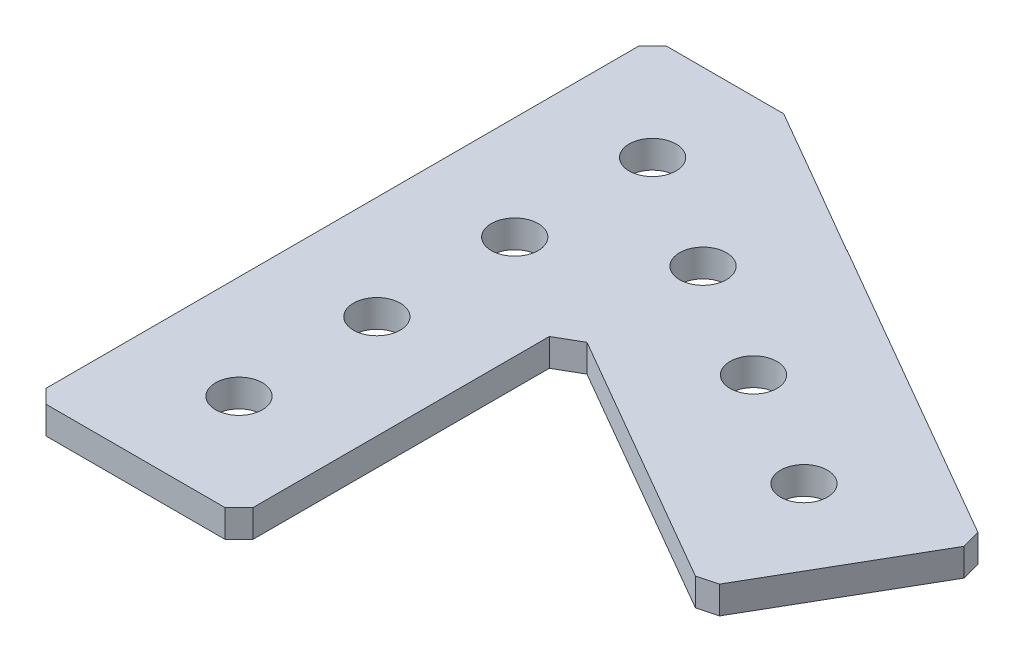
ISO-10303-21;
HEADER;
FILE_DESCRIPTION(('STEP AP214'),'2;1');
FILE_NAME('part.step','',(''),(''),'','','');
FILE_SCHEMA(('AUTOMOTIVE_DESIGN { 1 0 10303 214 1 1 1 1 }'));
ENDSEC;
DATA;
#1=APPLICATION_CONTEXT('core data for automotive mechanical design processes');
#2=APPLICATION_PROTOCOL_DEFINITION('international standard','automotive_design',2000,#1);
#3=PRODUCT_CONTEXT('',#1,'mechanical');
#4=PRODUCT('Part','Part','',(#3));
#5=PRODUCT_RELATED_PRODUCT_CATEGORY('part','',(#4));
#6=PRODUCT_DEFINITION_FORMATION('','',#4);
#7=PRODUCT_DEFINITION_CONTEXT('part definition',#1,'design');
#8=PRODUCT_DEFINITION('design','',#6,#7);
#9=PRODUCT_DEFINITION_SHAPE('','',#8);
#10=(LENGTH_UNIT() NAMED_UNIT(*) SI_UNIT(.MILLI.,.METRE.));
#11=(NAMED_UNIT(*) PLANE_ANGLE_UNIT() SI_UNIT($,.RADIAN.));
#12=(NAMED_UNIT(*) SI_UNIT($,.STERADIAN.) SOLID_ANGLE_UNIT());
#13=UNCERTAINTY_MEASURE_WITH_UNIT(LENGTH_MEASURE(1.E-05),#10,'distance_accuracy_value','');
#14=(GEOMETRIC_REPRESENTATION_CONTEXT(3) GLOBAL_UNCERTAINTY_ASSIGNED_CONTEXT((#13)) GLOBAL_UNIT_ASSIGNED_CONTEXT((#10,
#11,#12)) REPRESENTATION_CONTEXT('',''));
#15=CARTESIAN_POINT('',(0.,0.,0.));
#16=DIRECTION('',(0.,0.,1.));
#17=DIRECTION('',(1.,0.,0.));
#18=AXIS2_PLACEMENT_3D('',#15,#16,#17);
#19=CARTESIAN_POINT('',(7.50000000000001,2.,36.5));
#20=DIRECTION('',(-0.707106781186544,0.,-0.707106781186551));
#21=DIRECTION('',(-0.707106781186551,0.,0.707106781186544));
#22=AXIS2_PLACEMENT_3D('',#19,#20,#21);
#23=PLANE('',#22);
#24=DIRECTION('',(0.,1.,0.));
#25=VECTOR('',#24,1.);
#26=CARTESIAN_POINT('',(6.5,2.,37.5));
#27=LINE('',#26,#25);
#28=CARTESIAN_POINT('',(6.49999999999999,2.,37.5));
#29=VERTEX_POINT('',#28);
#30=CARTESIAN_POINT('',(6.5,0.,37.5));
#31=VERTEX_POINT('',#30);
#32=EDGE_CURVE('E151',#29,#31,#27,.F.);
#33=ORIENTED_EDGE('',*,*,#32,.T.);
#34=DIRECTION('',(-0.707106781186551,0.,0.707106781186544));
#35=VECTOR('',#34,1.);
#36=CARTESIAN_POINT('',(7.50000000000001,0.,36.5));
#37=LINE('',#36,#35);
#38=CARTESIAN_POINT('',(7.5,0.,36.5));
#39=VERTEX_POINT('',#38);
#40=EDGE_CURVE('E178',#39,#31,#37,.T.);
#41=ORIENTED_EDGE('',*,*,#40,.F.);
#42=DIRECTION('',(0.,1.,0.));
#43=VECTOR('',#42,1.);
#44=CARTESIAN_POINT('',(7.50000000000001,2.,36.5));
#45=LINE('',#44,#43);
#46=CARTESIAN_POINT('',(7.5,2.,36.5));
#47=VERTEX_POINT('',#46);
#48=EDGE_CURVE('E482',#39,#47,#45,.T.);
#49=ORIENTED_EDGE('',*,*,#48,.T.);
#50=DIRECTION('',(0.707106781186552,0.,-0.707106781186543));
#51=VECTOR('',#50,1.);
#52=CARTESIAN_POINT('',(6.5,2.,37.5));
#53=LINE('',#52,#51);
#54=EDGE_CURVE('E127',#29,#47,#53,.T.);
#55=ORIENTED_EDGE('',*,*,#54,.F.);
#56=EDGE_LOOP('',(#33,#41,#49,#55));
#57=FACE_BOUND('',#56,.T.);
#58=ADVANCED_FACE('F17',(#57),#23,.F.);
#59=CARTESIAN_POINT('',(29.2259526419165,2.,24.3791651245988));
#60=DIRECTION('',(-0.258819045102525,0.,-0.965925826289067));
#61=DIRECTION('',(-0.965925826289067,0.,0.258819045102525));
#62=AXIS2_PLACEMENT_3D('',#59,#60,#61);
#63=PLANE('',#62);
#64=DIRECTION('',(0.,1.,0.));
#65=VECTOR('',#64,1.);
#66=CARTESIAN_POINT('',(27.8599272381321,2.,24.7451905283832));
#67=LINE('',#66,#65);
#68=CARTESIAN_POINT('',(27.8599272381321,2.,24.7451905283832));
#69=VERTEX_POINT('',#68);
#70=CARTESIAN_POINT('',(27.8599272381321,0.,24.7451905283832));
#71=VERTEX_POINT('',#70);
#72=EDGE_CURVE('E537',#69,#71,#67,.F.);
#73=ORIENTED_EDGE('',*,*,#72,.T.);
#74=DIRECTION('',(-0.965925826289067,0.,0.258819045102525));
#75=VECTOR('',#74,1.);
#76=CARTESIAN_POINT('',(29.2259526419165,0.,24.3791651245988));
#77=LINE('',#76,#75);
#78=CARTESIAN_POINT('',(29.2259526419165,0.,24.3791651245988));
#79=VERTEX_POINT('',#78);
#80=EDGE_CURVE('E176',#79,#71,#77,.T.);
#81=ORIENTED_EDGE('',*,*,#80,.F.);
#82=DIRECTION('',(0.,1.,0.));
#83=VECTOR('',#82,1.);
#84=CARTESIAN_POINT('',(29.2259526419165,2.,24.3791651245988));
#85=LINE('',#84,#83);
#86=CARTESIAN_POINT('',(29.2259526419165,2.,24.3791651245988));
#87=VERTEX_POINT('',#86);
#88=EDGE_CURVE('E525',#79,#87,#85,.T.);
#89=ORIENTED_EDGE('',*,*,#88,.T.);
#90=DIRECTION('',(0.965925826289068,0.,-0.258819045102521));
#91=VECTOR('',#90,1.);
#92=CARTESIAN_POINT('',(27.8599272381321,2.,24.7451905283832));
#93=LINE('',#92,#91);
#94=EDGE_CURVE('E166',#69,#87,#93,.T.);
#95=ORIENTED_EDGE('',*,*,#94,.F.);
#96=EDGE_LOOP('',(#73,#81,#89,#95));
#97=FACE_BOUND('',#96,.T.);
#98=ADVANCED_FACE('F455',(#97),#63,.F.);
#99=CARTESIAN_POINT('',(35.359927238132,2.,11.7548094716166));
#100=DIRECTION('',(-0.965925826289066,0.,0.258819045102529));
#101=DIRECTION('',(0.258819045102529,0.,0.965925826289066));
#102=AXIS2_PLACEMENT_3D('',#99,#100,#101);
#103=PLANE('',#102);
#104=DIRECTION('',(0.,1.,0.));
#105=VECTOR('',#104,1.);
#106=CARTESIAN_POINT('',(35.7259526419165,2.,13.1208348754011));
#107=LINE('',#106,#105);
#108=CARTESIAN_POINT('',(35.7259526419165,2.,13.1208348754011));
#109=VERTEX_POINT('',#108);
#110=CARTESIAN_POINT('',(35.7259526419165,0.,13.1208348754011));
#111=VERTEX_POINT('',#110);
#112=EDGE_CURVE('E528',#109,#111,#107,.F.);
#113=ORIENTED_EDGE('',*,*,#112,.T.);
#114=DIRECTION('',(0.258819045102529,0.,0.965925826289066));
#115=VECTOR('',#114,1.);
#116=CARTESIAN_POINT('',(35.359927238132,0.,11.7548094716166));
#117=LINE('',#116,#115);
#118=CARTESIAN_POINT('',(35.359927238132,0.,11.7548094716166));
#119=VERTEX_POINT('',#118);
#120=EDGE_CURVE('E174',#119,#111,#117,.T.);
#121=ORIENTED_EDGE('',*,*,#120,.F.);
#122=DIRECTION('',(0.,1.,0.));
#123=VECTOR('',#122,1.);
#124=CARTESIAN_POINT('',(35.359927238132,2.,11.7548094716166));
#125=LINE('',#124,#123);
#126=CARTESIAN_POINT('',(35.359927238132,2.,11.7548094716166));
#127=VERTEX_POINT('',#126);
#128=EDGE_CURVE('E519',#119,#127,#125,.T.);
#129=ORIENTED_EDGE('',*,*,#128,.T.);
#130=DIRECTION('',(-0.258819045102522,0.,-0.965925826289068));
#131=VECTOR('',#130,1.);
#132=CARTESIAN_POINT('',(35.7259526419165,2.,13.1208348754011));
#133=LINE('',#132,#131);
#134=EDGE_CURVE('E164',#109,#127,#133,.T.);
#135=ORIENTED_EDGE('',*,*,#134,.F.);
#136=EDGE_LOOP('',(#113,#121,#129,#135));
#137=FACE_BOUND('',#136,.T.);
#138=ADVANCED_FACE('F446',(#137),#103,.F.);
#139=CARTESIAN_POINT('',(12.9048348660632,0.,-17.58131199324));
#140=DIRECTION('',(1.,0.,0.));
#141=DIRECTION('',(0.,0.,-1.));
#142=AXIS2_PLACEMENT_3D('',#139,#140,#141);
#143=PLANE('',#142);
#144=DIRECTION('',(0.,1.,0.));
#145=VECTOR('',#144,1.);
#146=CARTESIAN_POINT('',(12.9048348660632,0.,-1.18824976863152));
#147=LINE('',#146,#145);
#148=CARTESIAN_POINT('',(12.9048348660632,0.,-1.18824976863152));
#149=VERTEX_POINT('',#148);
#150=CARTESIAN_POINT('',(12.9048348660632,2.,-1.18824976863152));
#151=VERTEX_POINT('',#150);
#152=EDGE_CURVE('E510',#149,#151,#147,.T.);
#153=ORIENTED_EDGE('',*,*,#152,.T.);
#154=DIRECTION('',(0.,0.,1.));
#155=VECTOR('',#154,1.);
#156=CARTESIAN_POINT('',(12.9048348660632,2.,0.));
#157=LINE('',#156,#155);
#158=CARTESIAN_POINT('',(12.9048348660632,2.,-1.20964415407516));
#159=VERTEX_POINT('',#158);
#160=EDGE_CURVE('E162',#159,#151,#157,.T.);
#161=ORIENTED_EDGE('',*,*,#160,.F.);
#162=DIRECTION('',(0.,1.,0.));
#163=VECTOR('',#162,1.);
#164=CARTESIAN_POINT('',(12.9048348660632,2.,-1.20964415407516));
#165=LINE('',#164,#163);
#166=CARTESIAN_POINT('',(12.9048348660632,0.,-1.20964415407516));
#167=VERTEX_POINT('',#166);
#168=EDGE_CURVE('E513',#159,#167,#165,.F.);
#169=ORIENTED_EDGE('',*,*,#168,.T.);
#170=DIRECTION('',(0.,0.,-1.));
#171=VECTOR('',#170,1.);
#172=CARTESIAN_POINT('',(12.9048348660632,0.,-17.58131199324));
#173=LINE('',#172,#171);
#174=EDGE_CURVE('E172',#149,#167,#173,.T.);
#175=ORIENTED_EDGE('',*,*,#174,.F.);
#176=EDGE_LOOP('',(#153,#161,#169,#175));
#177=FACE_BOUND('',#176,.T.);
#178=ADVANCED_FACE('F438',(#177),#143,.F.);
#179=CARTESIAN_POINT('',(-7.5,2.,-6.50000000000001));
#180=DIRECTION('',(0.707106781186548,0.,0.707106781186548));
#181=DIRECTION('',(0.707106781186548,0.,-0.707106781186548));
#182=AXIS2_PLACEMENT_3D('',#179,#180,#181);
#183=PLANE('',#182);
#184=DIRECTION('',(0.,1.,0.));
#185=VECTOR('',#184,1.);
#186=CARTESIAN_POINT('',(-6.50000000000001,2.,-7.5));
#187=LINE('',#186,#185);
#188=CARTESIAN_POINT('',(-6.50000000000001,2.,-7.5));
#189=VERTEX_POINT('',#188);
#190=CARTESIAN_POINT('',(-6.50000000000001,0.,-7.5));
#191=VERTEX_POINT('',#190);
#192=EDGE_CURVE('E495',#189,#191,#187,.F.);
#193=ORIENTED_EDGE('',*,*,#192,.T.);
#194=DIRECTION('',(0.707106781186548,0.,-0.707106781186548));
#195=VECTOR('',#194,1.);
#196=CARTESIAN_POINT('',(-7.5,0.,-6.50000000000001));
#197=LINE('',#196,#195);
#198=CARTESIAN_POINT('',(-7.5,0.,-6.50000000000001));
#199=VERTEX_POINT('',#198);
#200=EDGE_CURVE('E35',#199,#191,#197,.T.);
#201=ORIENTED_EDGE('',*,*,#200,.F.);
#202=DIRECTION('',(0.,1.,0.));
#203=VECTOR('',#202,1.);
#204=CARTESIAN_POINT('',(-7.5,2.,-6.50000000000001));
#205=LINE('',#204,#203);
#206=CARTESIAN_POINT('',(-7.5,2.,-6.50000000000001));
#207=VERTEX_POINT('',#206);
#208=EDGE_CURVE('E493',#199,#207,#205,.T.);
#209=ORIENTED_EDGE('',*,*,#208,.T.);
#210=DIRECTION('',(-0.707106781186548,0.,0.707106781186548));
#211=VECTOR('',#210,1.);
#212=CARTESIAN_POINT('',(-6.50000000000001,2.,-7.5));
#213=LINE('',#212,#211);
#214=EDGE_CURVE('E143',#189,#207,#213,.T.);
#215=ORIENTED_EDGE('',*,*,#214,.F.);
#216=EDGE_LOOP('',(#193,#201,#209,#215));
#217=FACE_BOUND('',#216,.T.);
#218=ADVANCED_FACE('F430',(#217),#183,.F.);
#219=CARTESIAN_POINT('',(-6.5,2.,37.5));
#220=DIRECTION('',(0.70710678118655,0.,-0.707106781186545));
#221=DIRECTION('',(-0.707106781186545,0.,-0.70710678118655));
#222=AXIS2_PLACEMENT_3D('',#219,#220,#221);
#223=PLANE('',#222);
#224=DIRECTION('',(0.,1.,0.));
#225=VECTOR('',#224,1.);
#226=CARTESIAN_POINT('',(-7.5,2.,36.5));
#227=LINE('',#226,#225);
#228=CARTESIAN_POINT('',(-7.5,2.,36.5));
#229=VERTEX_POINT('',#228);
#230=CARTESIAN_POINT('',(-7.50000000000001,0.,36.5));
#231=VERTEX_POINT('',#230);
#232=EDGE_CURVE('E210',#229,#231,#227,.F.);
#233=ORIENTED_EDGE('',*,*,#232,.T.);
#234=DIRECTION('',(-0.707106781186545,0.,-0.70710678118655));
#235=VECTOR('',#234,1.);
#236=CARTESIAN_POINT('',(-6.5,0.,37.5));
#237=LINE('',#236,#235);
#238=CARTESIAN_POINT('',(-6.5,0.,37.5));
#239=VERTEX_POINT('',#238);
#240=EDGE_CURVE('E154',#239,#231,#237,.T.);
#241=ORIENTED_EDGE('',*,*,#240,.F.);
#242=DIRECTION('',(0.,1.,0.));
#243=VECTOR('',#242,1.);
#244=CARTESIAN_POINT('',(-6.5,2.,37.5));
#245=LINE('',#244,#243);
#246=CARTESIAN_POINT('',(-6.5,2.,37.5));
#247=VERTEX_POINT('',#246);
#248=EDGE_CURVE('E149',#239,#247,#245,.T.);
#249=ORIENTED_EDGE('',*,*,#248,.T.);
#250=DIRECTION('',(0.707106781186544,0.,0.707106781186551));
#251=VECTOR('',#250,1.);
#252=CARTESIAN_POINT('',(-7.5,2.,36.5));
#253=LINE('',#252,#251);
#254=EDGE_CURVE('E133',#229,#247,#253,.T.);
#255=ORIENTED_EDGE('',*,*,#254,.F.);
#256=EDGE_LOOP('',(#233,#241,#249,#255));
#257=FACE_BOUND('',#256,.T.);
#258=ADVANCED_FACE('F153',(#257),#223,.F.);
#259=CARTESIAN_POINT('',(0.,2.,0.));
#260=DIRECTION('',(0.,1.,0.));
#261=DIRECTION('',(0.,0.,1.));
#262=AXIS2_PLACEMENT_3D('',#259,#260,#261);
#263=PLANE('',#262);
#264=CARTESIAN_POINT('',(0.,2.,20.));
#265=DIRECTION('',(0.,-1.,0.));
#266=DIRECTION('',(0.,0.,-1.));
#267=AXIS2_PLACEMENT_3D('',#264,#265,#266);
#268=CIRCLE('',#267,1.7);
#269=CARTESIAN_POINT('',(0.,2.,18.3));
#270=VERTEX_POINT('',#269);
#271=EDGE_CURVE('E199',#270,#270,#268,.T.);
#272=ORIENTED_EDGE('',*,*,#271,.T.);
#273=EDGE_LOOP('',(#272));
#274=FACE_BOUND('',#273,.T.);
#275=CARTESIAN_POINT('',(0.,2.,30.));
#276=DIRECTION('',(0.,-1.,0.));
#277=DIRECTION('',(0.,0.,-1.));
#278=AXIS2_PLACEMENT_3D('',#275,#276,#277);
#279=CIRCLE('',#278,1.7);
#280=CARTESIAN_POINT('',(0.,2.,28.3));
#281=VERTEX_POINT('',#280);
#282=EDGE_CURVE('E202',#281,#281,#279,.T.);
#283=ORIENTED_EDGE('',*,*,#282,.T.);
#284=EDGE_LOOP('',(#283));
#285=FACE_BOUND('',#284,.T.);
#286=CARTESIAN_POINT('',(17.3205080756888,2.,9.99999999999996));
#287=DIRECTION('',(0.,-1.,0.));
#288=DIRECTION('',(0.,0.,-1.));
#289=AXIS2_PLACEMENT_3D('',#286,#287,#288);
#290=CIRCLE('',#289,1.7);
#291=CARTESIAN_POINT('',(17.3205080756888,2.,8.29999999999996));
#292=VERTEX_POINT('',#291);
#293=EDGE_CURVE('E205',#292,#292,#290,.T.);
#294=ORIENTED_EDGE('',*,*,#293,.T.);
#295=EDGE_LOOP('',(#294));
#296=FACE_BOUND('',#295,.T.);
#297=CARTESIAN_POINT('',(25.9807621135332,2.,14.9999999999999));
#298=DIRECTION('',(0.,-1.,0.));
#299=DIRECTION('',(0.,0.,-1.));
#300=AXIS2_PLACEMENT_3D('',#297,#298,#299);
#301=CIRCLE('',#300,1.7);
#302=CARTESIAN_POINT('',(25.9807621135332,2.,13.2999999999999));
#303=VERTEX_POINT('',#302);
#304=EDGE_CURVE('E208',#303,#303,#301,.T.);
#305=ORIENTED_EDGE('',*,*,#304,.T.);
#306=EDGE_LOOP('',(#305));
#307=FACE_BOUND('',#306,.T.);
#308=CARTESIAN_POINT('',(0.,2.,0.));
#309=DIRECTION('',(0.,-1.,0.));
#310=DIRECTION('',(0.,0.,-1.));
#311=AXIS2_PLACEMENT_3D('',#308,#309,#310);
#312=CIRCLE('',#311,1.7);
#313=CARTESIAN_POINT('',(0.,2.,-1.69999999999999));
#314=VERTEX_POINT('',#313);
#315=EDGE_CURVE('E155',#314,#314,#312,.T.);
#316=ORIENTED_EDGE('',*,*,#315,.T.);
#317=EDGE_LOOP('',(#316));
#318=FACE_BOUND('',#317,.T.);
#319=CARTESIAN_POINT('',(8.66025403784441,2.,4.99999999999998));
#320=DIRECTION('',(0.,-1.,0.));
#321=DIRECTION('',(0.,0.,-1.));
#322=AXIS2_PLACEMENT_3D('',#319,#320,#321);
#323=CIRCLE('',#322,1.7);
#324=CARTESIAN_POINT('',(8.66025403784441,2.,3.29999999999998));
#325=VERTEX_POINT('',#324);
#326=EDGE_CURVE('E158',#325,#325,#323,.T.);
#327=ORIENTED_EDGE('',*,*,#326,.T.);
#328=EDGE_LOOP('',(#327));
#329=FACE_BOUND('',#328,.T.);
#330=CARTESIAN_POINT('',(0.,2.,10.));
#331=DIRECTION('',(0.,-1.,0.));
#332=DIRECTION('',(0.,0.,-1.));
#333=AXIS2_PLACEMENT_3D('',#330,#331,#332);
#334=CIRCLE('',#333,1.7);
#335=CARTESIAN_POINT('',(0.,2.,8.30000000000001));
#336=VERTEX_POINT('',#335);
#337=EDGE_CURVE('E20',#336,#336,#334,.T.);
#338=ORIENTED_EDGE('',*,*,#337,.T.);
#339=EDGE_LOOP('',(#338));
#340=FACE_BOUND('',#339,.T.);
#341=DIRECTION('',(0.86602540378444,0.,0.499999999999998));
#342=VECTOR('',#341,1.);
#343=CARTESIAN_POINT('',(7.5,2.,-4.33012701892221));
#344=LINE('',#343,#342);
#345=CARTESIAN_POINT('',(7.49999999999934,2.,-4.33012701892259));
#346=VERTEX_POINT('',#345);
#347=CARTESIAN_POINT('',(2.00961894323341,2.,-7.5));
#348=VERTEX_POINT('',#347);
#349=EDGE_CURVE('E503',#346,#348,#344,.F.);
#350=ORIENTED_EDGE('',*,*,#349,.T.);
#351=DIRECTION('',(1.,0.,0.));
#352=VECTOR('',#351,1.);
#353=CARTESIAN_POINT('',(-7.5,2.,-7.5));
#354=LINE('',#353,#352);
#355=EDGE_CURVE('E497',#348,#189,#354,.F.);
#356=ORIENTED_EDGE('',*,*,#355,.T.);
#357=ORIENTED_EDGE('',*,*,#214,.T.);
#358=DIRECTION('',(0.,0.,-1.));
#359=VECTOR('',#358,1.);
#360=CARTESIAN_POINT('',(-7.5,2.,-7.5));
#361=LINE('',#360,#359);
#362=EDGE_CURVE('E138',#207,#229,#361,.F.);
#363=ORIENTED_EDGE('',*,*,#362,.T.);
#364=ORIENTED_EDGE('',*,*,#254,.T.);
#365=DIRECTION('',(-1.,0.,0.));
#366=VECTOR('',#365,1.);
#367=CARTESIAN_POINT('',(-7.5,2.,37.5));
#368=LINE('',#367,#366);
#369=EDGE_CURVE('E136',#247,#29,#368,.F.);
#370=ORIENTED_EDGE('',*,*,#369,.T.);
#371=ORIENTED_EDGE('',*,*,#54,.T.);
#372=DIRECTION('',(0.,0.,1.));
#373=VECTOR('',#372,1.);
#374=CARTESIAN_POINT('',(7.5,2.,-7.5));
#375=LINE('',#374,#373);
#376=CARTESIAN_POINT('',(7.5,2.,14.9903810567666));
#377=VERTEX_POINT('',#376);
#378=EDGE_CURVE('E544',#47,#377,#375,.F.);
#379=ORIENTED_EDGE('',*,*,#378,.T.);
#380=DIRECTION('',(0.866025403784435,0.,-0.500000000000006));
#381=VECTOR('',#380,1.);
#382=CARTESIAN_POINT('',(9.23205080756888,2.,13.9903810567665));
#383=LINE('',#382,#381);
#384=CARTESIAN_POINT('',(9.23205080756888,2.,13.9903810567665));
#385=VERTEX_POINT('',#384);
#386=EDGE_CURVE('E542',#385,#377,#383,.F.);
#387=ORIENTED_EDGE('',*,*,#386,.F.);
#388=DIRECTION('',(-0.86602540378444,0.,-0.499999999999998));
#389=VECTOR('',#388,1.);
#390=CARTESIAN_POINT('',(-10.2451905283833,2.,2.74519052838332));
#391=LINE('',#390,#389);
#392=EDGE_CURVE('E531',#385,#69,#391,.F.);
#393=ORIENTED_EDGE('',*,*,#392,.T.);
#394=ORIENTED_EDGE('',*,*,#94,.T.);
#395=DIRECTION('',(-0.499999999999998,0.,0.86602540378444));
#396=VECTOR('',#395,1.);
#397=CARTESIAN_POINT('',(28.7259526419165,2.,25.2451905283832));
#398=LINE('',#397,#396);
#399=EDGE_CURVE('E522',#87,#109,#398,.F.);
#400=ORIENTED_EDGE('',*,*,#399,.T.);
#401=ORIENTED_EDGE('',*,*,#134,.T.);
#402=DIRECTION('',(0.86602540378444,0.,0.499999999999998));
#403=VECTOR('',#402,1.);
#404=CARTESIAN_POINT('',(-2.74519052838331,2.,-10.2451905283833));
#405=LINE('',#404,#403);
#406=EDGE_CURVE('E516',#127,#159,#405,.F.);
#407=ORIENTED_EDGE('',*,*,#406,.T.);
#408=ORIENTED_EDGE('',*,*,#160,.T.);
#409=DIRECTION('',(0.864539754700675,0.,0.502564436209027));
#410=VECTOR('',#409,1.);
#411=CARTESIAN_POINT('',(12.9048348660632,2.,-1.18824976863152));
#412=LINE('',#411,#410);
#413=EDGE_CURVE('E508',#151,#346,#412,.F.);
#414=ORIENTED_EDGE('',*,*,#413,.T.);
#415=EDGE_LOOP('',(#350,#356,#357,#363,#364,#370,#371,#379,#387,#393,#394,#400,#401,#407,#408,#414));
#416=FACE_BOUND('',#415,.T.);
#417=ADVANCED_FACE('F135',(#274,#285,#296,#307,#318,#329,#340,#416),#263,.T.);
#418=CARTESIAN_POINT('',(0.,2.,10.));
#419=DIRECTION('',(0.,-1.,0.));
#420=DIRECTION('',(0.,0.,-1.));
#421=AXIS2_PLACEMENT_3D('',#418,#419,#420);
#422=CYLINDRICAL_SURFACE('',#421,1.7);
#423=CARTESIAN_POINT('',(0.,0.,10.));
#424=DIRECTION('',(0.,-1.,0.));
#425=DIRECTION('',(0.,0.,-1.));
#426=AXIS2_PLACEMENT_3D('',#423,#424,#425);
#427=CIRCLE('',#426,1.7);
#428=CARTESIAN_POINT('',(0.,0.,8.30000000000001));
#429=VERTEX_POINT('',#428);
#430=EDGE_CURVE('E196',#429,#429,#427,.T.);
#431=ORIENTED_EDGE('',*,*,#430,.T.);
#432=EDGE_LOOP('',(#431));
#433=FACE_BOUND('',#432,.T.);
#434=ORIENTED_EDGE('',*,*,#337,.F.);
#435=EDGE_LOOP('',(#434));
#436=FACE_BOUND('',#435,.T.);
#437=ADVANCED_FACE('F218',(#433,#436),#422,.F.);
#438=CARTESIAN_POINT('',(8.66025403784441,2.,4.99999999999998));
#439=DIRECTION('',(0.,-1.,0.));
#440=DIRECTION('',(0.,0.,-1.));
#441=AXIS2_PLACEMENT_3D('',#438,#439,#440);
#442=CYLINDRICAL_SURFACE('',#441,1.7);
#443=CARTESIAN_POINT('',(8.66025403784441,0.,4.99999999999998));
#444=DIRECTION('',(0.,-1.,0.));
#445=DIRECTION('',(0.,0.,-1.));
#446=AXIS2_PLACEMENT_3D('',#443,#444,#445);
#447=CIRCLE('',#446,1.7);
#448=CARTESIAN_POINT('',(8.66025403784441,0.,3.29999999999998));
#449=VERTEX_POINT('',#448);
#450=EDGE_CURVE('E193',#449,#449,#447,.T.);
#451=ORIENTED_EDGE('',*,*,#450,.T.);
#452=EDGE_LOOP('',(#451));
#453=FACE_BOUND('',#452,.T.);
#454=ORIENTED_EDGE('',*,*,#326,.F.);
#455=EDGE_LOOP('',(#454));
#456=FACE_BOUND('',#455,.T.);
#457=ADVANCED_FACE('F220',(#453,#456),#442,.F.);
#458=CARTESIAN_POINT('',(0.,2.,0.));
#459=DIRECTION('',(0.,-1.,0.));
#460=DIRECTION('',(0.,0.,-1.));
#461=AXIS2_PLACEMENT_3D('',#458,#459,#460);
#462=CYLINDRICAL_SURFACE('',#461,1.7);
#463=CARTESIAN_POINT('',(0.,0.,0.));
#464=DIRECTION('',(0.,-1.,0.));
#465=DIRECTION('',(0.,0.,-1.));
#466=AXIS2_PLACEMENT_3D('',#463,#464,#465);
#467=CIRCLE('',#466,1.7);
#468=CARTESIAN_POINT('',(0.,0.,-1.69999999999999));
#469=VERTEX_POINT('',#468);
#470=EDGE_CURVE('E189',#469,#469,#467,.T.);
#471=ORIENTED_EDGE('',*,*,#470,.T.);
#472=EDGE_LOOP('',(#471));
#473=FACE_BOUND('',#472,.T.);
#474=ORIENTED_EDGE('',*,*,#315,.F.);
#475=EDGE_LOOP('',(#474));
#476=FACE_BOUND('',#475,.T.);
#477=ADVANCED_FACE('F228',(#473,#476),#462,.F.);
#478=CARTESIAN_POINT('',(-7.5,2.,37.5));
#479=DIRECTION('',(0.,0.,-1.));
#480=DIRECTION('',(-1.,0.,0.));
#481=AXIS2_PLACEMENT_3D('',#478,#479,#480);
#482=PLANE('',#481);
#483=ORIENTED_EDGE('',*,*,#32,.F.);
#484=ORIENTED_EDGE('',*,*,#369,.F.);
#485=ORIENTED_EDGE('',*,*,#248,.F.);
#486=DIRECTION('',(1.,0.,0.));
#487=VECTOR('',#486,1.);
#488=CARTESIAN_POINT('',(0.,0.,37.5));
#489=LINE('',#488,#487);
#490=EDGE_CURVE('E192',#239,#31,#489,.T.);
#491=ORIENTED_EDGE('',*,*,#490,.T.);
#492=EDGE_LOOP('',(#483,#484,#485,#491));
#493=FACE_BOUND('',#492,.T.);
#494=ADVANCED_FACE('F147',(#493),#482,.F.);
#495=CARTESIAN_POINT('',(7.5,2.,-7.5));
#496=DIRECTION('',(-1.,0.,0.));
#497=DIRECTION('',(0.,0.,1.));
#498=AXIS2_PLACEMENT_3D('',#495,#496,#497);
#499=PLANE('',#498);
#500=DIRECTION('',(0.,1.,0.));
#501=VECTOR('',#500,1.);
#502=CARTESIAN_POINT('',(7.5,2.,14.9903810567666));
#503=LINE('',#502,#501);
#504=CARTESIAN_POINT('',(7.5,0.,14.9903810567666));
#505=VERTEX_POINT('',#504);
#506=EDGE_CURVE('E540',#377,#505,#503,.F.);
#507=ORIENTED_EDGE('',*,*,#506,.F.);
#508=ORIENTED_EDGE('',*,*,#378,.F.);
#509=ORIENTED_EDGE('',*,*,#48,.F.);
#510=DIRECTION('',(0.,0.,1.));
#511=VECTOR('',#510,1.);
#512=CARTESIAN_POINT('',(7.50000000000001,0.,0.));
#513=LINE('',#512,#511);
#514=EDGE_CURVE('E484',#39,#505,#513,.F.);
#515=ORIENTED_EDGE('',*,*,#514,.T.);
#516=EDGE_LOOP('',(#507,#508,#509,#515));
#517=FACE_BOUND('',#516,.T.);
#518=ADVANCED_FACE('F289',(#517),#499,.F.);
#519=CARTESIAN_POINT('',(9.23205080756888,2.,13.9903810567665));
#520=DIRECTION('',(0.500000000000006,0.,0.866025403784435));
#521=DIRECTION('',(0.866025403784435,0.,-0.500000000000006));
#522=AXIS2_PLACEMENT_3D('',#519,#520,#521);
#523=PLANE('',#522);
#524=DIRECTION('',(0.866025403784434,0.,-0.500000000000007));
#525=VECTOR('',#524,1.);
#526=CARTESIAN_POINT('',(7.5,0.,14.9903810567666));
#527=LINE('',#526,#525);
#528=CARTESIAN_POINT('',(9.23205080756888,0.,13.9903810567665));
#529=VERTEX_POINT('',#528);
#530=EDGE_CURVE('E487',#505,#529,#527,.T.);
#531=ORIENTED_EDGE('',*,*,#530,.T.);
#532=DIRECTION('',(0.,1.,0.));
#533=VECTOR('',#532,1.);
#534=CARTESIAN_POINT('',(9.23205080756888,2.,13.9903810567665));
#535=LINE('',#534,#533);
#536=EDGE_CURVE('E534',#529,#385,#535,.T.);
#537=ORIENTED_EDGE('',*,*,#536,.T.);
#538=ORIENTED_EDGE('',*,*,#386,.T.);
#539=ORIENTED_EDGE('',*,*,#506,.T.);
#540=EDGE_LOOP('',(#531,#537,#538,#539));
#541=FACE_BOUND('',#540,.T.);
#542=ADVANCED_FACE('F285',(#541),#523,.T.);
#543=CARTESIAN_POINT('',(-10.2451905283833,2.,2.74519052838332));
#544=DIRECTION('',(0.499999999999998,0.,-0.86602540378444));
#545=DIRECTION('',(-0.86602540378444,0.,-0.499999999999998));
#546=AXIS2_PLACEMENT_3D('',#543,#544,#545);
#547=PLANE('',#546);
#548=ORIENTED_EDGE('',*,*,#536,.F.);
#549=DIRECTION('',(0.86602540378444,0.,0.499999999999998));
#550=VECTOR('',#549,1.);
#551=CARTESIAN_POINT('',(9.23205080756888,0.,13.9903810567665));
#552=LINE('',#551,#550);
#553=EDGE_CURVE('E554',#529,#71,#552,.T.);
#554=ORIENTED_EDGE('',*,*,#553,.T.);
#555=ORIENTED_EDGE('',*,*,#72,.F.);
#556=ORIENTED_EDGE('',*,*,#392,.F.);
#557=EDGE_LOOP('',(#548,#554,#555,#556));
#558=FACE_BOUND('',#557,.T.);
#559=ADVANCED_FACE('F281',(#558),#547,.F.);
#560=CARTESIAN_POINT('',(28.7259526419165,2.,25.2451905283832));
#561=DIRECTION('',(-0.86602540378444,0.,-0.499999999999998));
#562=DIRECTION('',(-0.499999999999998,0.,0.86602540378444));
#563=AXIS2_PLACEMENT_3D('',#560,#561,#562);
#564=PLANE('',#563);
#565=ORIENTED_EDGE('',*,*,#88,.F.);
#566=DIRECTION('',(0.499999999999998,0.,-0.86602540378444));
#567=VECTOR('',#566,1.);
#568=CARTESIAN_POINT('',(29.2259526419165,0.,24.3791651245988));
#569=LINE('',#568,#567);
#570=EDGE_CURVE('E555',#79,#111,#569,.T.);
#571=ORIENTED_EDGE('',*,*,#570,.T.);
#572=ORIENTED_EDGE('',*,*,#112,.F.);
#573=ORIENTED_EDGE('',*,*,#399,.F.);
#574=EDGE_LOOP('',(#565,#571,#572,#573));
#575=FACE_BOUND('',#574,.T.);
#576=ADVANCED_FACE('F277',(#575),#564,.F.);
#577=CARTESIAN_POINT('',(-2.74519052838331,2.,-10.2451905283833));
#578=DIRECTION('',(-0.499999999999998,0.,0.86602540378444));
#579=DIRECTION('',(0.86602540378444,0.,0.499999999999998));
#580=AXIS2_PLACEMENT_3D('',#577,#578,#579);
#581=PLANE('',#580);
#582=ORIENTED_EDGE('',*,*,#168,.F.);
#583=ORIENTED_EDGE('',*,*,#406,.F.);
#584=ORIENTED_EDGE('',*,*,#128,.F.);
#585=DIRECTION('',(-0.86602540378444,0.,-0.499999999999998));
#586=VECTOR('',#585,1.);
#587=CARTESIAN_POINT('',(35.359927238132,0.,11.7548094716166));
#588=LINE('',#587,#586);
#589=EDGE_CURVE('E560',#119,#167,#588,.T.);
#590=ORIENTED_EDGE('',*,*,#589,.T.);
#591=EDGE_LOOP('',(#582,#583,#584,#590));
#592=FACE_BOUND('',#591,.T.);
#593=ADVANCED_FACE('F273',(#592),#581,.F.);
#594=CARTESIAN_POINT('',(12.9048348660632,0.,-1.18824976863152));
#595=DIRECTION('',(-0.502564436209027,0.,0.864539754700675));
#596=DIRECTION('',(0.864539754700675,0.,0.502564436209027));
#597=AXIS2_PLACEMENT_3D('',#594,#595,#596);
#598=PLANE('',#597);
#599=ORIENTED_EDGE('',*,*,#152,.F.);
#600=DIRECTION('',(-0.864539754700675,0.,-0.502564436209026));
#601=VECTOR('',#600,1.);
#602=CARTESIAN_POINT('',(12.9048348660632,0.,-1.18824976863152));
#603=LINE('',#602,#601);
#604=CARTESIAN_POINT('',(7.49999999999934,0.,-4.33012701892259));
#605=VERTEX_POINT('',#604);
#606=EDGE_CURVE('E563',#149,#605,#603,.T.);
#607=ORIENTED_EDGE('',*,*,#606,.T.);
#608=DIRECTION('',(0.,1.,0.));
#609=VECTOR('',#608,1.);
#610=CARTESIAN_POINT('',(7.5,0.,-4.33012701892221));
#611=LINE('',#610,#609);
#612=EDGE_CURVE('E505',#605,#346,#611,.T.);
#613=ORIENTED_EDGE('',*,*,#612,.T.);
#614=ORIENTED_EDGE('',*,*,#413,.F.);
#615=EDGE_LOOP('',(#599,#607,#613,#614));
#616=FACE_BOUND('',#615,.T.);
#617=ADVANCED_FACE('F269',(#616),#598,.F.);
#618=CARTESIAN_POINT('',(7.5,0.,-4.33012701892221));
#619=DIRECTION('',(-0.499999999999998,0.,0.86602540378444));
#620=DIRECTION('',(0.86602540378444,0.,0.499999999999998));
#621=AXIS2_PLACEMENT_3D('',#618,#619,#620);
#622=PLANE('',#621);
#623=ORIENTED_EDGE('',*,*,#612,.F.);
#624=DIRECTION('',(-0.86602540378444,0.,-0.499999999999998));
#625=VECTOR('',#624,1.);
#626=CARTESIAN_POINT('',(7.5,0.,-4.33012701892221));
#627=LINE('',#626,#625);
#628=CARTESIAN_POINT('',(2.00961894323341,0.,-7.5));
#629=VERTEX_POINT('',#628);
#630=EDGE_CURVE('E566',#605,#629,#627,.T.);
#631=ORIENTED_EDGE('',*,*,#630,.T.);
#632=DIRECTION('',(0.,1.,0.));
#633=VECTOR('',#632,1.);
#634=CARTESIAN_POINT('',(2.00961894323341,2.,-7.5));
#635=LINE('',#634,#633);
#636=EDGE_CURVE('E500',#629,#348,#635,.T.);
#637=ORIENTED_EDGE('',*,*,#636,.T.);
#638=ORIENTED_EDGE('',*,*,#349,.F.);
#639=EDGE_LOOP('',(#623,#631,#637,#638));
#640=FACE_BOUND('',#639,.T.);
#641=ADVANCED_FACE('F265',(#640),#622,.F.);
#642=CARTESIAN_POINT('',(-7.5,2.,-7.5));
#643=DIRECTION('',(0.,0.,1.));
#644=DIRECTION('',(1.,0.,0.));
#645=AXIS2_PLACEMENT_3D('',#642,#643,#644);
#646=PLANE('',#645);
#647=ORIENTED_EDGE('',*,*,#192,.F.);
#648=ORIENTED_EDGE('',*,*,#355,.F.);
#649=ORIENTED_EDGE('',*,*,#636,.F.);
#650=DIRECTION('',(1.,0.,0.));
#651=VECTOR('',#650,1.);
#652=CARTESIAN_POINT('',(0.,0.,-7.5));
#653=LINE('',#652,#651);
#654=EDGE_CURVE('E569',#629,#191,#653,.F.);
#655=ORIENTED_EDGE('',*,*,#654,.T.);
#656=EDGE_LOOP('',(#647,#648,#649,#655));
#657=FACE_BOUND('',#656,.T.);
#658=ADVANCED_FACE('F261',(#657),#646,.F.);
#659=CARTESIAN_POINT('',(-7.5,2.,-7.5));
#660=DIRECTION('',(1.,0.,0.));
#661=DIRECTION('',(0.,0.,-1.));
#662=AXIS2_PLACEMENT_3D('',#659,#660,#661);
#663=PLANE('',#662);
#664=ORIENTED_EDGE('',*,*,#232,.F.);
#665=ORIENTED_EDGE('',*,*,#362,.F.);
#666=ORIENTED_EDGE('',*,*,#208,.F.);
#667=DIRECTION('',(0.,0.,1.));
#668=VECTOR('',#667,1.);
#669=CARTESIAN_POINT('',(-7.5,0.,0.));
#670=LINE('',#669,#668);
#671=EDGE_CURVE('E188',#199,#231,#670,.T.);
#672=ORIENTED_EDGE('',*,*,#671,.T.);
#673=EDGE_LOOP('',(#664,#665,#666,#672));
#674=FACE_BOUND('',#673,.T.);
#675=ADVANCED_FACE('F257',(#674),#663,.F.);
#676=CARTESIAN_POINT('',(25.9807621135332,2.,14.9999999999999));
#677=DIRECTION('',(0.,-1.,0.));
#678=DIRECTION('',(0.,0.,-1.));
#679=AXIS2_PLACEMENT_3D('',#676,#677,#678);
#680=CYLINDRICAL_SURFACE('',#679,1.7);
#681=CARTESIAN_POINT('',(25.9807621135332,0.,14.9999999999999));
#682=DIRECTION('',(0.,-1.,0.));
#683=DIRECTION('',(0.,0.,-1.));
#684=AXIS2_PLACEMENT_3D('',#681,#682,#683);
#685=CIRCLE('',#684,1.7);
#686=CARTESIAN_POINT('',(25.9807621135332,0.,13.2999999999999));
#687=VERTEX_POINT('',#686);
#688=EDGE_CURVE('E185',#687,#687,#685,.T.);
#689=ORIENTED_EDGE('',*,*,#688,.T.);
#690=EDGE_LOOP('',(#689));
#691=FACE_BOUND('',#690,.T.);
#692=ORIENTED_EDGE('',*,*,#304,.F.);
#693=EDGE_LOOP('',(#692));
#694=FACE_BOUND('',#693,.T.);
#695=ADVANCED_FACE('F253',(#691,#694),#680,.F.);
#696=CARTESIAN_POINT('',(17.3205080756888,2.,9.99999999999996));
#697=DIRECTION('',(0.,-1.,0.));
#698=DIRECTION('',(0.,0.,-1.));
#699=AXIS2_PLACEMENT_3D('',#696,#697,#698);
#700=CYLINDRICAL_SURFACE('',#699,1.7);
#701=CARTESIAN_POINT('',(17.3205080756888,0.,9.99999999999996));
#702=DIRECTION('',(0.,-1.,0.));
#703=DIRECTION('',(0.,0.,-1.));
#704=AXIS2_PLACEMENT_3D('',#701,#702,#703);
#705=CIRCLE('',#704,1.7);
#706=CARTESIAN_POINT('',(17.3205080756888,0.,8.29999999999996));
#707=VERTEX_POINT('',#706);
#708=EDGE_CURVE('E182',#707,#707,#705,.T.);
#709=ORIENTED_EDGE('',*,*,#708,.T.);
#710=EDGE_LOOP('',(#709));
#711=FACE_BOUND('',#710,.T.);
#712=ORIENTED_EDGE('',*,*,#293,.F.);
#713=EDGE_LOOP('',(#712));
#714=FACE_BOUND('',#713,.T.);
#715=ADVANCED_FACE('F249',(#711,#714),#700,.F.);
#716=CARTESIAN_POINT('',(0.,2.,30.));
#717=DIRECTION('',(0.,-1.,0.));
#718=DIRECTION('',(0.,0.,-1.));
#719=AXIS2_PLACEMENT_3D('',#716,#717,#718);
#720=CYLINDRICAL_SURFACE('',#719,1.7);
#721=CARTESIAN_POINT('',(0.,0.,30.));
#722=DIRECTION('',(0.,-1.,0.));
#723=DIRECTION('',(0.,0.,-1.));
#724=AXIS2_PLACEMENT_3D('',#721,#722,#723);
#725=CIRCLE('',#724,1.7);
#726=CARTESIAN_POINT('',(0.,0.,28.3));
#727=VERTEX_POINT('',#726);
#728=EDGE_CURVE('E26',#727,#727,#725,.T.);
#729=ORIENTED_EDGE('',*,*,#728,.T.);
#730=EDGE_LOOP('',(#729));
#731=FACE_BOUND('',#730,.T.);
#732=ORIENTED_EDGE('',*,*,#282,.F.);
#733=EDGE_LOOP('',(#732));
#734=FACE_BOUND('',#733,.T.);
#735=ADVANCED_FACE('F241',(#731,#734),#720,.F.);
#736=CARTESIAN_POINT('',(0.,2.,20.));
#737=DIRECTION('',(0.,-1.,0.));
#738=DIRECTION('',(0.,0.,-1.));
#739=AXIS2_PLACEMENT_3D('',#736,#737,#738);
#740=CYLINDRICAL_SURFACE('',#739,1.7);
#741=CARTESIAN_POINT('',(0.,0.,20.));
#742=DIRECTION('',(0.,-1.,0.));
#743=DIRECTION('',(0.,0.,-1.));
#744=AXIS2_PLACEMENT_3D('',#741,#742,#743);
#745=CIRCLE('',#744,1.7);
#746=CARTESIAN_POINT('',(0.,0.,18.3));
#747=VERTEX_POINT('',#746);
#748=EDGE_CURVE('E10',#747,#747,#745,.T.);
#749=ORIENTED_EDGE('',*,*,#748,.T.);
#750=EDGE_LOOP('',(#749));
#751=FACE_BOUND('',#750,.T.);
#752=ORIENTED_EDGE('',*,*,#271,.F.);
#753=EDGE_LOOP('',(#752));
#754=FACE_BOUND('',#753,.T.);
#755=ADVANCED_FACE('F235',(#751,#754),#740,.F.);
#756=CARTESIAN_POINT('',(0.,0.,0.));
#757=DIRECTION('',(0.,1.,0.));
#758=DIRECTION('',(0.,0.,1.));
#759=AXIS2_PLACEMENT_3D('',#756,#757,#758);
#760=PLANE('',#759);
#761=ORIENTED_EDGE('',*,*,#748,.F.);
#762=EDGE_LOOP('',(#761));
#763=FACE_BOUND('',#762,.T.);
#764=ORIENTED_EDGE('',*,*,#728,.F.);
#765=EDGE_LOOP('',(#764));
#766=FACE_BOUND('',#765,.T.);
#767=ORIENTED_EDGE('',*,*,#708,.F.);
#768=EDGE_LOOP('',(#767));
#769=FACE_BOUND('',#768,.T.);
#770=ORIENTED_EDGE('',*,*,#688,.F.);
#771=EDGE_LOOP('',(#770));
#772=FACE_BOUND('',#771,.T.);
#773=ORIENTED_EDGE('',*,*,#200,.T.);
#774=ORIENTED_EDGE('',*,*,#654,.F.);
#775=ORIENTED_EDGE('',*,*,#630,.F.);
#776=ORIENTED_EDGE('',*,*,#606,.F.);
#777=ORIENTED_EDGE('',*,*,#174,.T.);
#778=ORIENTED_EDGE('',*,*,#589,.F.);
#779=ORIENTED_EDGE('',*,*,#120,.T.);
#780=ORIENTED_EDGE('',*,*,#570,.F.);
#781=ORIENTED_EDGE('',*,*,#80,.T.);
#782=ORIENTED_EDGE('',*,*,#553,.F.);
#783=ORIENTED_EDGE('',*,*,#530,.F.);
#784=ORIENTED_EDGE('',*,*,#514,.F.);
#785=ORIENTED_EDGE('',*,*,#40,.T.);
#786=ORIENTED_EDGE('',*,*,#490,.F.);
#787=ORIENTED_EDGE('',*,*,#240,.T.);
#788=ORIENTED_EDGE('',*,*,#671,.F.);
#789=EDGE_LOOP('',(#773,#774,#775,#776,#777,#778,#779,#780,#781,#782,#783,#784,#785,#786,#787,#788));
#790=FACE_BOUND('',#789,.T.);
#791=ORIENTED_EDGE('',*,*,#470,.F.);
#792=EDGE_LOOP('',(#791));
#793=FACE_BOUND('',#792,.T.);
#794=ORIENTED_EDGE('',*,*,#450,.F.);
#795=EDGE_LOOP('',(#794));
#796=FACE_BOUND('',#795,.T.);
#797=ORIENTED_EDGE('',*,*,#430,.F.);
#798=EDGE_LOOP('',(#797));
#799=FACE_BOUND('',#798,.T.);
#800=ADVANCED_FACE('F233',(#763,#766,#769,#772,#790,#793,#796,#799),#760,.F.);
#801=CLOSED_SHELL('',(#58,#98,#138,#178,#218,#258,#417,#437,#457,#477,#494,#518,#542,#559,#576,
#593,#617,#641,#658,#675,#695,#715,#735,#755,#800));
#802=MANIFOLD_SOLID_BREP('B1',#801);
#803=ADVANCED_BREP_SHAPE_REPRESENTATION('',(#18,#802),#14);
#804=SHAPE_DEFINITION_REPRESENTATION(#9,#803);
ENDSEC;
END-ISO-10303-21;
